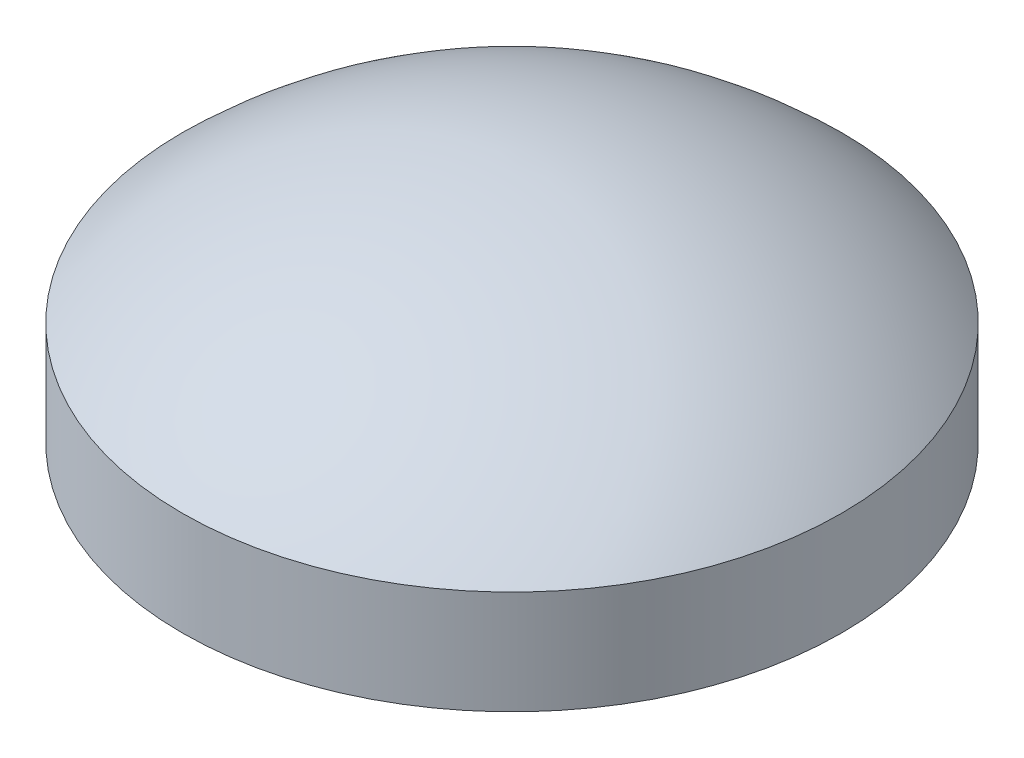
ISO-10303-21;
HEADER;
FILE_DESCRIPTION(('STEP AP214'),'2;1');
FILE_NAME('part.step','',(''),(''),'','','');
FILE_SCHEMA(('AUTOMOTIVE_DESIGN { 1 0 10303 214 1 1 1 1 }'));
ENDSEC;
DATA;
#1=APPLICATION_CONTEXT('core data for automotive mechanical design processes');
#2=APPLICATION_PROTOCOL_DEFINITION('international standard','automotive_design',2000,#1);
#3=PRODUCT_CONTEXT('',#1,'mechanical');
#4=PRODUCT('Part','Part','',(#3));
#5=PRODUCT_RELATED_PRODUCT_CATEGORY('part','',(#4));
#6=PRODUCT_DEFINITION_FORMATION('','',#4);
#7=PRODUCT_DEFINITION_CONTEXT('part definition',#1,'design');
#8=PRODUCT_DEFINITION('design','',#6,#7);
#9=PRODUCT_DEFINITION_SHAPE('','',#8);
#10=(LENGTH_UNIT() NAMED_UNIT(*) SI_UNIT(.MILLI.,.METRE.));
#11=(NAMED_UNIT(*) PLANE_ANGLE_UNIT() SI_UNIT($,.RADIAN.));
#12=(NAMED_UNIT(*) SI_UNIT($,.STERADIAN.) SOLID_ANGLE_UNIT());
#13=UNCERTAINTY_MEASURE_WITH_UNIT(LENGTH_MEASURE(1.E-05),#10,'distance_accuracy_value','');
#14=(GEOMETRIC_REPRESENTATION_CONTEXT(3) GLOBAL_UNCERTAINTY_ASSIGNED_CONTEXT((#13)) GLOBAL_UNIT_ASSIGNED_CONTEXT((#10,
#11,#12)) REPRESENTATION_CONTEXT('',''));
#15=CARTESIAN_POINT('',(0.,0.,0.));
#16=DIRECTION('',(0.,0.,1.));
#17=DIRECTION('',(1.,0.,0.));
#18=AXIS2_PLACEMENT_3D('',#15,#16,#17);
#19=CARTESIAN_POINT('',(0.,12.5,0.));
#20=DIRECTION('',(0.,-1.,0.));
#21=DIRECTION('',(0.,0.,-1.));
#22=AXIS2_PLACEMENT_3D('',#19,#20,#21);
#23=CYLINDRICAL_SURFACE('',#22,39.75);
#24=CARTESIAN_POINT('',(0.,12.5,0.));
#25=DIRECTION('',(0.,1.,0.));
#26=DIRECTION('',(0.,0.,1.));
#27=AXIS2_PLACEMENT_3D('',#24,#25,#26);
#28=CIRCLE('',#27,39.75);
#29=CARTESIAN_POINT('',(0.,12.5,39.75));
#30=VERTEX_POINT('',#29);
#31=EDGE_CURVE('E10',#30,#30,#28,.T.);
#32=ORIENTED_EDGE('',*,*,#31,.F.);
#33=EDGE_LOOP('',(#32));
#34=FACE_BOUND('',#33,.T.);
#35=CARTESIAN_POINT('',(0.,0.,0.));
#36=DIRECTION('',(0.,1.,0.));
#37=DIRECTION('',(0.,0.,1.));
#38=AXIS2_PLACEMENT_3D('',#35,#36,#37);
#39=CIRCLE('',#38,39.75);
#40=CARTESIAN_POINT('',(0.,0.,39.75));
#41=VERTEX_POINT('',#40);
#42=EDGE_CURVE('E43',#41,#41,#39,.T.);
#43=ORIENTED_EDGE('',*,*,#42,.T.);
#44=EDGE_LOOP('',(#43));
#45=FACE_BOUND('',#44,.T.);
#46=ADVANCED_FACE('F36',(#34,#45),#23,.T.);
#47=CARTESIAN_POINT('',(0.,-28.876953125,0.));
#48=DIRECTION('',(0.,0.,1.));
#49=DIRECTION('',(1.,0.,0.));
#50=AXIS2_PLACEMENT_3D('',#47,#48,#49);
#51=SPHERICAL_SURFACE('',#50,57.376953125);
#52=CARTESIAN_POINT('',(0.,-28.876953125,0.));
#53=DIRECTION('',(0.,1.,0.));
#54=DIRECTION('',(0.,0.,1.));
#55=AXIS2_PLACEMENT_3D('',#52,#53,#54);
#56=SPHERICAL_SURFACE('',#55,57.376953125);
#57=ORIENTED_EDGE('',*,*,#31,.T.);
#58=EDGE_LOOP('',(#57));
#59=FACE_BOUND('',#58,.T.);
#60=ADVANCED_FACE('F38',(#59),#56,.T.);
#61=CARTESIAN_POINT('',(0.,0.,0.));
#62=DIRECTION('',(0.,1.,0.));
#63=DIRECTION('',(0.,0.,1.));
#64=AXIS2_PLACEMENT_3D('',#61,#62,#63);
#65=PLANE('',#64);
#66=ORIENTED_EDGE('',*,*,#42,.F.);
#67=EDGE_LOOP('',(#66));
#68=FACE_BOUND('',#67,.T.);
#69=ADVANCED_FACE('F50',(#68),#65,.F.);
#70=CLOSED_SHELL('',(#46,#60,#69));
#71=MANIFOLD_SOLID_BREP('B2',#70);
#72=ADVANCED_BREP_SHAPE_REPRESENTATION('',(#18,#71),#14);
#73=SHAPE_DEFINITION_REPRESENTATION(#9,#72);
ENDSEC;
END-ISO-10303-21;
